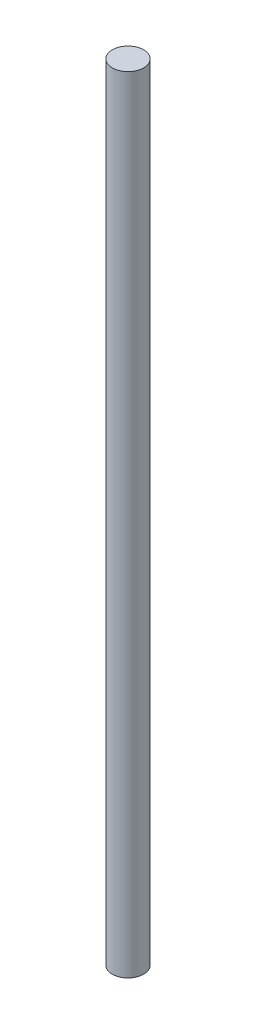
ISO-10303-21;
HEADER;
FILE_DESCRIPTION(('STEP AP214'),'2;1');
FILE_NAME('part.step','',(''),(''),'','','');
FILE_SCHEMA(('AUTOMOTIVE_DESIGN { 1 0 10303 214 1 1 1 1 }'));
ENDSEC;
DATA;
#1=APPLICATION_CONTEXT('core data for automotive mechanical design processes');
#2=APPLICATION_PROTOCOL_DEFINITION('international standard','automotive_design',2000,#1);
#3=PRODUCT_CONTEXT('',#1,'mechanical');
#4=PRODUCT('Part','Part','',(#3));
#5=PRODUCT_RELATED_PRODUCT_CATEGORY('part','',(#4));
#6=PRODUCT_DEFINITION_FORMATION('','',#4);
#7=PRODUCT_DEFINITION_CONTEXT('part definition',#1,'design');
#8=PRODUCT_DEFINITION('design','',#6,#7);
#9=PRODUCT_DEFINITION_SHAPE('','',#8);
#10=(LENGTH_UNIT() NAMED_UNIT(*) SI_UNIT(.MILLI.,.METRE.));
#11=(NAMED_UNIT(*) PLANE_ANGLE_UNIT() SI_UNIT($,.RADIAN.));
#12=(NAMED_UNIT(*) SI_UNIT($,.STERADIAN.) SOLID_ANGLE_UNIT());
#13=UNCERTAINTY_MEASURE_WITH_UNIT(LENGTH_MEASURE(1.E-05),#10,'distance_accuracy_value','');
#14=(GEOMETRIC_REPRESENTATION_CONTEXT(3) GLOBAL_UNCERTAINTY_ASSIGNED_CONTEXT((#13)) GLOBAL_UNIT_ASSIGNED_CONTEXT((#10,
#11,#12)) REPRESENTATION_CONTEXT('',''));
#15=CARTESIAN_POINT('',(0.,0.,0.));
#16=DIRECTION('',(0.,0.,1.));
#17=DIRECTION('',(1.,0.,0.));
#18=AXIS2_PLACEMENT_3D('',#15,#16,#17);
#19=CARTESIAN_POINT('',(0.,200.,0.));
#20=DIRECTION('',(0.,-1.,0.));
#21=DIRECTION('',(0.,0.,-1.));
#22=AXIS2_PLACEMENT_3D('',#19,#20,#21);
#23=CYLINDRICAL_SURFACE('',#22,4.);
#24=CARTESIAN_POINT('',(0.,200.,0.));
#25=DIRECTION('',(0.,1.,0.));
#26=DIRECTION('',(0.,0.,1.));
#27=AXIS2_PLACEMENT_3D('',#24,#25,#26);
#28=CIRCLE('',#27,4.);
#29=CARTESIAN_POINT('',(0.,200.,4.));
#30=VERTEX_POINT('',#29);
#31=EDGE_CURVE('E10',#30,#30,#28,.T.);
#32=ORIENTED_EDGE('',*,*,#31,.F.);
#33=EDGE_LOOP('',(#32));
#34=FACE_BOUND('',#33,.T.);
#35=CARTESIAN_POINT('',(0.,0.,0.));
#36=DIRECTION('',(0.,1.,0.));
#37=DIRECTION('',(0.,0.,1.));
#38=AXIS2_PLACEMENT_3D('',#35,#36,#37);
#39=CIRCLE('',#38,4.);
#40=CARTESIAN_POINT('',(0.,0.,4.));
#41=VERTEX_POINT('',#40);
#42=EDGE_CURVE('E32',#41,#41,#39,.T.);
#43=ORIENTED_EDGE('',*,*,#42,.T.);
#44=EDGE_LOOP('',(#43));
#45=FACE_BOUND('',#44,.T.);
#46=ADVANCED_FACE('F29',(#34,#45),#23,.T.);
#47=CARTESIAN_POINT('',(0.,200.,0.));
#48=DIRECTION('',(0.,1.,0.));
#49=DIRECTION('',(0.,0.,1.));
#50=AXIS2_PLACEMENT_3D('',#47,#48,#49);
#51=PLANE('',#50);
#52=ORIENTED_EDGE('',*,*,#31,.T.);
#53=EDGE_LOOP('',(#52));
#54=FACE_BOUND('',#53,.T.);
#55=ADVANCED_FACE('F44',(#54),#51,.T.);
#56=CARTESIAN_POINT('',(0.,0.,0.));
#57=DIRECTION('',(0.,1.,0.));
#58=DIRECTION('',(0.,0.,1.));
#59=AXIS2_PLACEMENT_3D('',#56,#57,#58);
#60=PLANE('',#59);
#61=ORIENTED_EDGE('',*,*,#42,.F.);
#62=EDGE_LOOP('',(#61));
#63=FACE_BOUND('',#62,.T.);
#64=ADVANCED_FACE('F42',(#63),#60,.F.);
#65=CLOSED_SHELL('',(#46,#55,#64));
#66=MANIFOLD_SOLID_BREP('B2',#65);
#67=ADVANCED_BREP_SHAPE_REPRESENTATION('',(#18,#66),#14);
#68=SHAPE_DEFINITION_REPRESENTATION(#9,#67);
ENDSEC;
END-ISO-10303-21;
